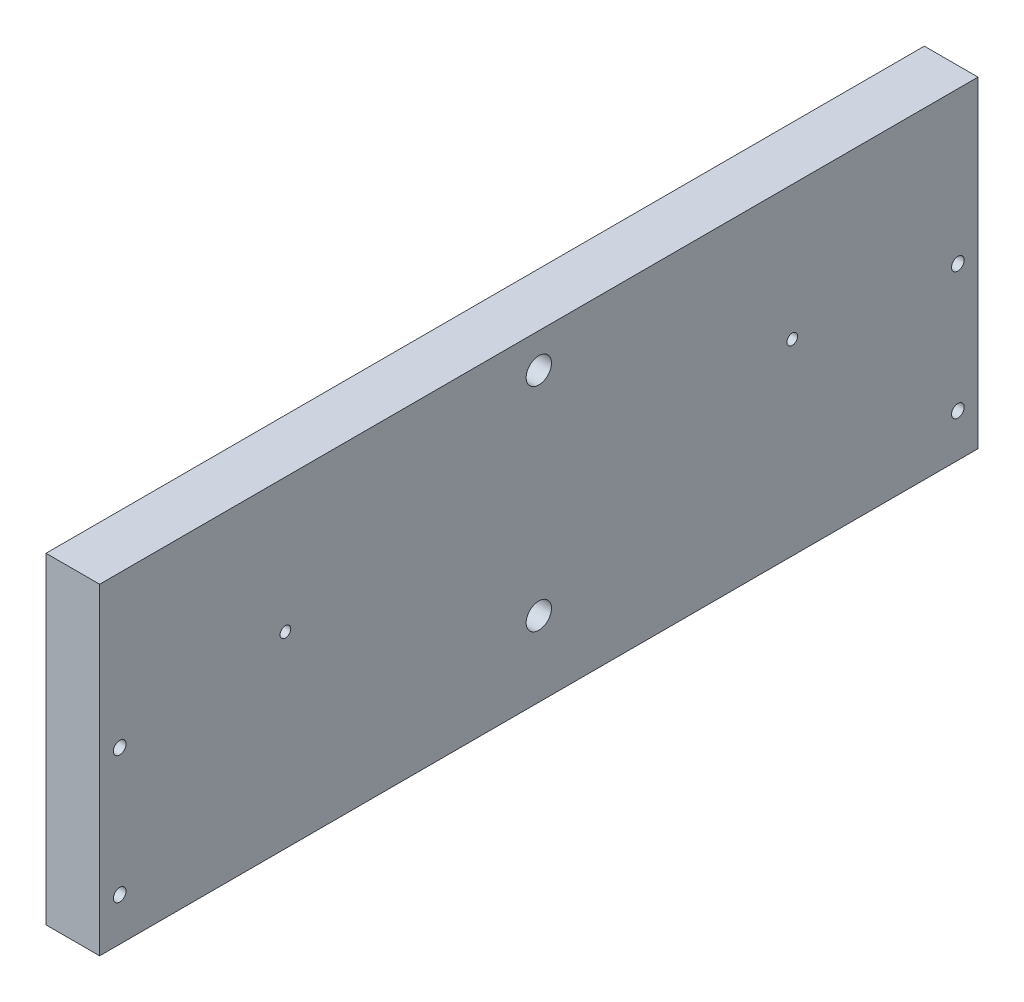
ISO-10303-21;
HEADER;
FILE_DESCRIPTION(('STEP AP214'),'2;1');
FILE_NAME('part.step','',(''),(''),'','','');
FILE_SCHEMA(('AUTOMOTIVE_DESIGN { 1 0 10303 214 1 1 1 1 }'));
ENDSEC;
DATA;
#1=APPLICATION_CONTEXT('core data for automotive mechanical design processes');
#2=APPLICATION_PROTOCOL_DEFINITION('international standard','automotive_design',2000,#1);
#3=PRODUCT_CONTEXT('',#1,'mechanical');
#4=PRODUCT('Part','Part','',(#3));
#5=PRODUCT_RELATED_PRODUCT_CATEGORY('part','',(#4));
#6=PRODUCT_DEFINITION_FORMATION('','',#4);
#7=PRODUCT_DEFINITION_CONTEXT('part definition',#1,'design');
#8=PRODUCT_DEFINITION('design','',#6,#7);
#9=PRODUCT_DEFINITION_SHAPE('','',#8);
#10=(LENGTH_UNIT() NAMED_UNIT(*) SI_UNIT(.MILLI.,.METRE.));
#11=(NAMED_UNIT(*) PLANE_ANGLE_UNIT() SI_UNIT($,.RADIAN.));
#12=(NAMED_UNIT(*) SI_UNIT($,.STERADIAN.) SOLID_ANGLE_UNIT());
#13=UNCERTAINTY_MEASURE_WITH_UNIT(LENGTH_MEASURE(1.E-05),#10,'distance_accuracy_value','');
#14=(GEOMETRIC_REPRESENTATION_CONTEXT(3) GLOBAL_UNCERTAINTY_ASSIGNED_CONTEXT((#13)) GLOBAL_UNIT_ASSIGNED_CONTEXT((#10,
#11,#12)) REPRESENTATION_CONTEXT('',''));
#15=CARTESIAN_POINT('',(0.,0.,0.));
#16=DIRECTION('',(0.,0.,1.));
#17=DIRECTION('',(1.,0.,0.));
#18=AXIS2_PLACEMENT_3D('',#15,#16,#17);
#19=CARTESIAN_POINT('',(12.7,0.,0.));
#20=DIRECTION('',(-1.,0.,0.));
#21=DIRECTION('',(0.,0.,1.));
#22=AXIS2_PLACEMENT_3D('',#19,#20,#21);
#23=PLANE('',#22);
#24=DIRECTION('',(0.,-1.,0.));
#25=VECTOR('',#24,1.);
#26=CARTESIAN_POINT('',(12.7,0.,0.));
#27=LINE('',#26,#25);
#28=CARTESIAN_POINT('',(12.7,76.2,0.));
#29=VERTEX_POINT('',#28);
#30=CARTESIAN_POINT('',(12.7,0.,0.));
#31=VERTEX_POINT('',#30);
#32=EDGE_CURVE('E85',#29,#31,#27,.T.);
#33=ORIENTED_EDGE('',*,*,#32,.T.);
#34=DIRECTION('',(0.,0.,-1.));
#35=VECTOR('',#34,1.);
#36=CARTESIAN_POINT('',(12.7,0.,0.));
#37=LINE('',#36,#35);
#38=CARTESIAN_POINT('',(12.7,0.,-207.9625));
#39=VERTEX_POINT('',#38);
#40=EDGE_CURVE('E80',#31,#39,#37,.T.);
#41=ORIENTED_EDGE('',*,*,#40,.T.);
#42=DIRECTION('',(0.,1.,0.));
#43=VECTOR('',#42,1.);
#44=CARTESIAN_POINT('',(12.7,0.,-207.9625));
#45=LINE('',#44,#43);
#46=CARTESIAN_POINT('',(12.7,76.2,-207.9625));
#47=VERTEX_POINT('',#46);
#48=EDGE_CURVE('E83',#39,#47,#45,.T.);
#49=ORIENTED_EDGE('',*,*,#48,.T.);
#50=DIRECTION('',(0.,0.,1.));
#51=VECTOR('',#50,1.);
#52=CARTESIAN_POINT('',(12.7,76.2,0.));
#53=LINE('',#52,#51);
#54=EDGE_CURVE('E50',#47,#29,#53,.T.);
#55=ORIENTED_EDGE('',*,*,#54,.T.);
#56=EDGE_LOOP('',(#33,#41,#49,#55));
#57=FACE_BOUND('',#56,.T.);
#58=CARTESIAN_POINT('',(12.7,68.072,-103.98125));
#59=DIRECTION('',(1.,0.,0.));
#60=DIRECTION('',(0.,0.,-1.));
#61=AXIS2_PLACEMENT_3D('',#58,#59,#60);
#62=CIRCLE('',#61,3.00000000000001);
#63=CARTESIAN_POINT('',(12.7,68.072,-106.98125));
#64=VERTEX_POINT('',#63);
#65=EDGE_CURVE('E100',#64,#64,#62,.T.);
#66=ORIENTED_EDGE('',*,*,#65,.F.);
#67=EDGE_LOOP('',(#66));
#68=FACE_BOUND('',#67,.T.);
#69=CARTESIAN_POINT('',(12.7,17.78,-103.98125));
#70=DIRECTION('',(1.,0.,0.));
#71=DIRECTION('',(0.,0.,-1.));
#72=AXIS2_PLACEMENT_3D('',#69,#70,#71);
#73=CIRCLE('',#72,3.00000000000001);
#74=CARTESIAN_POINT('',(12.7,17.78,-106.98125));
#75=VERTEX_POINT('',#74);
#76=EDGE_CURVE('E115',#75,#75,#73,.T.);
#77=ORIENTED_EDGE('',*,*,#76,.F.);
#78=EDGE_LOOP('',(#77));
#79=FACE_BOUND('',#78,.T.);
#80=CARTESIAN_POINT('',(12.7,44.45,-43.981250056));
#81=DIRECTION('',(1.,0.,0.));
#82=DIRECTION('',(0.,0.,-1.));
#83=AXIS2_PLACEMENT_3D('',#80,#81,#82);
#84=CIRCLE('',#83,1.26999999999999);
#85=CARTESIAN_POINT('',(12.7,44.45,-45.251250056));
#86=VERTEX_POINT('',#85);
#87=EDGE_CURVE('E121',#86,#86,#84,.T.);
#88=ORIENTED_EDGE('',*,*,#87,.F.);
#89=EDGE_LOOP('',(#88));
#90=FACE_BOUND('',#89,.T.);
#91=CARTESIAN_POINT('',(12.7,44.45,-163.981249944));
#92=DIRECTION('',(1.,0.,0.));
#93=DIRECTION('',(0.,0.,-1.));
#94=AXIS2_PLACEMENT_3D('',#91,#92,#93);
#95=CIRCLE('',#94,1.27000000000003);
#96=CARTESIAN_POINT('',(12.7,44.45,-165.251249944));
#97=VERTEX_POINT('',#96);
#98=EDGE_CURVE('E127',#97,#97,#95,.T.);
#99=ORIENTED_EDGE('',*,*,#98,.F.);
#100=EDGE_LOOP('',(#99));
#101=FACE_BOUND('',#100,.T.);
#102=CARTESIAN_POINT('',(12.7,40.3225,-4.7625));
#103=DIRECTION('',(1.,0.,0.));
#104=DIRECTION('',(0.,0.,-1.));
#105=AXIS2_PLACEMENT_3D('',#102,#103,#104);
#106=CIRCLE('',#105,1.5);
#107=CARTESIAN_POINT('',(12.7,40.3225,-6.2625));
#108=VERTEX_POINT('',#107);
#109=EDGE_CURVE('E133',#108,#108,#106,.T.);
#110=ORIENTED_EDGE('',*,*,#109,.F.);
#111=EDGE_LOOP('',(#110));
#112=FACE_BOUND('',#111,.T.);
#113=CARTESIAN_POINT('',(12.7,10.16,-4.7625));
#114=DIRECTION('',(1.,0.,0.));
#115=DIRECTION('',(0.,0.,-1.));
#116=AXIS2_PLACEMENT_3D('',#113,#114,#115);
#117=CIRCLE('',#116,1.5);
#118=CARTESIAN_POINT('',(12.7,10.16,-6.2625));
#119=VERTEX_POINT('',#118);
#120=EDGE_CURVE('E139',#119,#119,#117,.T.);
#121=ORIENTED_EDGE('',*,*,#120,.F.);
#122=EDGE_LOOP('',(#121));
#123=FACE_BOUND('',#122,.T.);
#124=CARTESIAN_POINT('',(12.7,40.3225,-203.2));
#125=DIRECTION('',(1.,0.,0.));
#126=DIRECTION('',(0.,0.,-1.));
#127=AXIS2_PLACEMENT_3D('',#124,#125,#126);
#128=CIRCLE('',#127,1.5);
#129=CARTESIAN_POINT('',(12.7,40.3225,-204.7));
#130=VERTEX_POINT('',#129);
#131=EDGE_CURVE('E145',#130,#130,#128,.T.);
#132=ORIENTED_EDGE('',*,*,#131,.F.);
#133=EDGE_LOOP('',(#132));
#134=FACE_BOUND('',#133,.T.);
#135=CARTESIAN_POINT('',(12.7,10.16,-203.2));
#136=DIRECTION('',(1.,0.,0.));
#137=DIRECTION('',(0.,0.,-1.));
#138=AXIS2_PLACEMENT_3D('',#135,#136,#137);
#139=CIRCLE('',#138,1.5);
#140=CARTESIAN_POINT('',(12.7,10.16,-204.7));
#141=VERTEX_POINT('',#140);
#142=EDGE_CURVE('E151',#141,#141,#139,.T.);
#143=ORIENTED_EDGE('',*,*,#142,.F.);
#144=EDGE_LOOP('',(#143));
#145=FACE_BOUND('',#144,.T.);
#146=ADVANCED_FACE('F33',(#57,#68,#79,#90,#101,#112,#123,#134,#145),#23,.F.);
#147=CARTESIAN_POINT('',(0.,0.,0.));
#148=DIRECTION('',(-1.,0.,0.));
#149=DIRECTION('',(0.,0.,1.));
#150=AXIS2_PLACEMENT_3D('',#147,#148,#149);
#151=PLANE('',#150);
#152=CARTESIAN_POINT('',(0.,40.3225,-203.2));
#153=DIRECTION('',(1.,0.,0.));
#154=DIRECTION('',(0.,0.,-1.));
#155=AXIS2_PLACEMENT_3D('',#152,#153,#154);
#156=CIRCLE('',#155,1.5);
#157=CARTESIAN_POINT('',(0.,40.3225,-204.7));
#158=VERTEX_POINT('',#157);
#159=EDGE_CURVE('E148',#158,#158,#156,.T.);
#160=ORIENTED_EDGE('',*,*,#159,.T.);
#161=EDGE_LOOP('',(#160));
#162=FACE_BOUND('',#161,.T.);
#163=CARTESIAN_POINT('',(0.,40.3225,-4.7625));
#164=DIRECTION('',(1.,0.,0.));
#165=DIRECTION('',(0.,0.,-1.));
#166=AXIS2_PLACEMENT_3D('',#163,#164,#165);
#167=CIRCLE('',#166,1.5);
#168=CARTESIAN_POINT('',(0.,40.3225,-6.2625));
#169=VERTEX_POINT('',#168);
#170=EDGE_CURVE('E136',#169,#169,#167,.T.);
#171=ORIENTED_EDGE('',*,*,#170,.T.);
#172=EDGE_LOOP('',(#171));
#173=FACE_BOUND('',#172,.T.);
#174=CARTESIAN_POINT('',(0.,44.45,-43.981250056));
#175=DIRECTION('',(1.,0.,0.));
#176=DIRECTION('',(0.,0.,-1.));
#177=AXIS2_PLACEMENT_3D('',#174,#175,#176);
#178=CIRCLE('',#177,1.26999999999999);
#179=CARTESIAN_POINT('',(0.,44.45,-45.251250056));
#180=VERTEX_POINT('',#179);
#181=EDGE_CURVE('E124',#180,#180,#178,.T.);
#182=ORIENTED_EDGE('',*,*,#181,.T.);
#183=EDGE_LOOP('',(#182));
#184=FACE_BOUND('',#183,.T.);
#185=CARTESIAN_POINT('',(0.,68.072,-103.98125));
#186=DIRECTION('',(1.,0.,0.));
#187=DIRECTION('',(0.,0.,-1.));
#188=AXIS2_PLACEMENT_3D('',#185,#186,#187);
#189=CIRCLE('',#188,3.00000000000001);
#190=CARTESIAN_POINT('',(0.,68.072,-106.98125));
#191=VERTEX_POINT('',#190);
#192=EDGE_CURVE('E112',#191,#191,#189,.T.);
#193=ORIENTED_EDGE('',*,*,#192,.T.);
#194=EDGE_LOOP('',(#193));
#195=FACE_BOUND('',#194,.T.);
#196=DIRECTION('',(0.,-1.,0.));
#197=VECTOR('',#196,1.);
#198=CARTESIAN_POINT('',(0.,0.,0.));
#199=LINE('',#198,#197);
#200=CARTESIAN_POINT('',(0.,76.2,0.));
#201=VERTEX_POINT('',#200);
#202=CARTESIAN_POINT('',(0.,0.,0.));
#203=VERTEX_POINT('',#202);
#204=EDGE_CURVE('E97',#201,#203,#199,.T.);
#205=ORIENTED_EDGE('',*,*,#204,.F.);
#206=DIRECTION('',(0.,0.,1.));
#207=VECTOR('',#206,1.);
#208=CARTESIAN_POINT('',(0.,76.2,0.));
#209=LINE('',#208,#207);
#210=CARTESIAN_POINT('',(0.,76.2,-207.9625));
#211=VERTEX_POINT('',#210);
#212=EDGE_CURVE('E73',#211,#201,#209,.T.);
#213=ORIENTED_EDGE('',*,*,#212,.F.);
#214=DIRECTION('',(0.,1.,0.));
#215=VECTOR('',#214,1.);
#216=CARTESIAN_POINT('',(0.,0.,-207.9625));
#217=LINE('',#216,#215);
#218=CARTESIAN_POINT('',(0.,0.,-207.9625));
#219=VERTEX_POINT('',#218);
#220=EDGE_CURVE('E67',#219,#211,#217,.T.);
#221=ORIENTED_EDGE('',*,*,#220,.F.);
#222=DIRECTION('',(0.,0.,-1.));
#223=VECTOR('',#222,1.);
#224=CARTESIAN_POINT('',(0.,0.,0.));
#225=LINE('',#224,#223);
#226=EDGE_CURVE('E89',#203,#219,#225,.T.);
#227=ORIENTED_EDGE('',*,*,#226,.F.);
#228=EDGE_LOOP('',(#205,#213,#221,#227));
#229=FACE_BOUND('',#228,.T.);
#230=CARTESIAN_POINT('',(0.,17.78,-103.98125));
#231=DIRECTION('',(1.,0.,0.));
#232=DIRECTION('',(0.,0.,-1.));
#233=AXIS2_PLACEMENT_3D('',#230,#231,#232);
#234=CIRCLE('',#233,3.00000000000001);
#235=CARTESIAN_POINT('',(0.,17.78,-106.98125));
#236=VERTEX_POINT('',#235);
#237=EDGE_CURVE('E118',#236,#236,#234,.T.);
#238=ORIENTED_EDGE('',*,*,#237,.T.);
#239=EDGE_LOOP('',(#238));
#240=FACE_BOUND('',#239,.T.);
#241=CARTESIAN_POINT('',(0.,44.45,-163.981249944));
#242=DIRECTION('',(1.,0.,0.));
#243=DIRECTION('',(0.,0.,-1.));
#244=AXIS2_PLACEMENT_3D('',#241,#242,#243);
#245=CIRCLE('',#244,1.27000000000003);
#246=CARTESIAN_POINT('',(0.,44.45,-165.251249944));
#247=VERTEX_POINT('',#246);
#248=EDGE_CURVE('E130',#247,#247,#245,.T.);
#249=ORIENTED_EDGE('',*,*,#248,.T.);
#250=EDGE_LOOP('',(#249));
#251=FACE_BOUND('',#250,.T.);
#252=CARTESIAN_POINT('',(0.,10.16,-4.7625));
#253=DIRECTION('',(1.,0.,0.));
#254=DIRECTION('',(0.,0.,-1.));
#255=AXIS2_PLACEMENT_3D('',#252,#253,#254);
#256=CIRCLE('',#255,1.5);
#257=CARTESIAN_POINT('',(0.,10.16,-6.2625));
#258=VERTEX_POINT('',#257);
#259=EDGE_CURVE('E142',#258,#258,#256,.T.);
#260=ORIENTED_EDGE('',*,*,#259,.T.);
#261=EDGE_LOOP('',(#260));
#262=FACE_BOUND('',#261,.T.);
#263=CARTESIAN_POINT('',(0.,10.16,-203.2));
#264=DIRECTION('',(1.,0.,0.));
#265=DIRECTION('',(0.,0.,-1.));
#266=AXIS2_PLACEMENT_3D('',#263,#264,#265);
#267=CIRCLE('',#266,1.5);
#268=CARTESIAN_POINT('',(0.,10.16,-204.7));
#269=VERTEX_POINT('',#268);
#270=EDGE_CURVE('E154',#269,#269,#267,.T.);
#271=ORIENTED_EDGE('',*,*,#270,.T.);
#272=EDGE_LOOP('',(#271));
#273=FACE_BOUND('',#272,.T.);
#274=ADVANCED_FACE('F108',(#162,#173,#184,#195,#229,#240,#251,#262,#273),#151,.T.);
#275=CARTESIAN_POINT('',(12.7,0.,0.));
#276=DIRECTION('',(0.,0.,-1.));
#277=DIRECTION('',(-1.,0.,0.));
#278=AXIS2_PLACEMENT_3D('',#275,#276,#277);
#279=PLANE('',#278);
#280=ORIENTED_EDGE('',*,*,#204,.T.);
#281=DIRECTION('',(-1.,0.,0.));
#282=VECTOR('',#281,1.);
#283=CARTESIAN_POINT('',(12.7,0.,0.));
#284=LINE('',#283,#282);
#285=EDGE_CURVE('E11',#31,#203,#284,.T.);
#286=ORIENTED_EDGE('',*,*,#285,.F.);
#287=ORIENTED_EDGE('',*,*,#32,.F.);
#288=DIRECTION('',(-1.,0.,0.));
#289=VECTOR('',#288,1.);
#290=CARTESIAN_POINT('',(12.7,76.2,0.));
#291=LINE('',#290,#289);
#292=EDGE_CURVE('E93',#29,#201,#291,.T.);
#293=ORIENTED_EDGE('',*,*,#292,.T.);
#294=EDGE_LOOP('',(#280,#286,#287,#293));
#295=FACE_BOUND('',#294,.T.);
#296=ADVANCED_FACE('F35',(#295),#279,.F.);
#297=CARTESIAN_POINT('',(12.7,0.,0.));
#298=DIRECTION('',(0.,1.,0.));
#299=DIRECTION('',(0.,0.,1.));
#300=AXIS2_PLACEMENT_3D('',#297,#298,#299);
#301=PLANE('',#300);
#302=ORIENTED_EDGE('',*,*,#226,.T.);
#303=DIRECTION('',(-1.,0.,0.));
#304=VECTOR('',#303,1.);
#305=CARTESIAN_POINT('',(12.7,0.,-207.9625));
#306=LINE('',#305,#304);
#307=EDGE_CURVE('E42',#39,#219,#306,.T.);
#308=ORIENTED_EDGE('',*,*,#307,.F.);
#309=ORIENTED_EDGE('',*,*,#40,.F.);
#310=ORIENTED_EDGE('',*,*,#285,.T.);
#311=EDGE_LOOP('',(#302,#308,#309,#310));
#312=FACE_BOUND('',#311,.T.);
#313=ADVANCED_FACE('F88',(#312),#301,.F.);
#314=CARTESIAN_POINT('',(12.7,0.,-207.9625));
#315=DIRECTION('',(0.,0.,1.));
#316=DIRECTION('',(1.,0.,0.));
#317=AXIS2_PLACEMENT_3D('',#314,#315,#316);
#318=PLANE('',#317);
#319=ORIENTED_EDGE('',*,*,#220,.T.);
#320=DIRECTION('',(-1.,0.,0.));
#321=VECTOR('',#320,1.);
#322=CARTESIAN_POINT('',(12.7,76.2,-207.9625));
#323=LINE('',#322,#321);
#324=EDGE_CURVE('E90',#47,#211,#323,.T.);
#325=ORIENTED_EDGE('',*,*,#324,.F.);
#326=ORIENTED_EDGE('',*,*,#48,.F.);
#327=ORIENTED_EDGE('',*,*,#307,.T.);
#328=EDGE_LOOP('',(#319,#325,#326,#327));
#329=FACE_BOUND('',#328,.T.);
#330=ADVANCED_FACE('F91',(#329),#318,.F.);
#331=CARTESIAN_POINT('',(12.7,76.2,0.));
#332=DIRECTION('',(0.,-1.,0.));
#333=DIRECTION('',(0.,0.,-1.));
#334=AXIS2_PLACEMENT_3D('',#331,#332,#333);
#335=PLANE('',#334);
#336=ORIENTED_EDGE('',*,*,#212,.T.);
#337=ORIENTED_EDGE('',*,*,#292,.F.);
#338=ORIENTED_EDGE('',*,*,#54,.F.);
#339=ORIENTED_EDGE('',*,*,#324,.T.);
#340=EDGE_LOOP('',(#336,#337,#338,#339));
#341=FACE_BOUND('',#340,.T.);
#342=ADVANCED_FACE('F105',(#341),#335,.F.);
#343=CARTESIAN_POINT('',(12.7,68.072,-103.98125));
#344=DIRECTION('',(-1.,0.,0.));
#345=DIRECTION('',(0.,0.,1.));
#346=AXIS2_PLACEMENT_3D('',#343,#344,#345);
#347=CYLINDRICAL_SURFACE('',#346,3.00000000000001);
#348=ORIENTED_EDGE('',*,*,#65,.T.);
#349=EDGE_LOOP('',(#348));
#350=FACE_BOUND('',#349,.T.);
#351=ORIENTED_EDGE('',*,*,#192,.F.);
#352=EDGE_LOOP('',(#351));
#353=FACE_BOUND('',#352,.T.);
#354=ADVANCED_FACE('F171',(#350,#353),#347,.F.);
#355=CARTESIAN_POINT('',(12.7,17.78,-103.98125));
#356=DIRECTION('',(-1.,0.,0.));
#357=DIRECTION('',(0.,0.,1.));
#358=AXIS2_PLACEMENT_3D('',#355,#356,#357);
#359=CYLINDRICAL_SURFACE('',#358,3.00000000000001);
#360=ORIENTED_EDGE('',*,*,#76,.T.);
#361=EDGE_LOOP('',(#360));
#362=FACE_BOUND('',#361,.T.);
#363=ORIENTED_EDGE('',*,*,#237,.F.);
#364=EDGE_LOOP('',(#363));
#365=FACE_BOUND('',#364,.T.);
#366=ADVANCED_FACE('F217',(#362,#365),#359,.F.);
#367=CARTESIAN_POINT('',(12.7,44.45,-43.981250056));
#368=DIRECTION('',(-1.,0.,0.));
#369=DIRECTION('',(0.,0.,1.));
#370=AXIS2_PLACEMENT_3D('',#367,#368,#369);
#371=CYLINDRICAL_SURFACE('',#370,1.26999999999999);
#372=ORIENTED_EDGE('',*,*,#87,.T.);
#373=EDGE_LOOP('',(#372));
#374=FACE_BOUND('',#373,.T.);
#375=ORIENTED_EDGE('',*,*,#181,.F.);
#376=EDGE_LOOP('',(#375));
#377=FACE_BOUND('',#376,.T.);
#378=ADVANCED_FACE('F225',(#374,#377),#371,.F.);
#379=CARTESIAN_POINT('',(12.7,44.45,-163.981249944));
#380=DIRECTION('',(-1.,0.,0.));
#381=DIRECTION('',(0.,0.,1.));
#382=AXIS2_PLACEMENT_3D('',#379,#380,#381);
#383=CYLINDRICAL_SURFACE('',#382,1.27000000000003);
#384=ORIENTED_EDGE('',*,*,#98,.T.);
#385=EDGE_LOOP('',(#384));
#386=FACE_BOUND('',#385,.T.);
#387=ORIENTED_EDGE('',*,*,#248,.F.);
#388=EDGE_LOOP('',(#387));
#389=FACE_BOUND('',#388,.T.);
#390=ADVANCED_FACE('F233',(#386,#389),#383,.F.);
#391=CARTESIAN_POINT('',(12.7,40.3225,-4.7625));
#392=DIRECTION('',(-1.,0.,0.));
#393=DIRECTION('',(0.,0.,1.));
#394=AXIS2_PLACEMENT_3D('',#391,#392,#393);
#395=CYLINDRICAL_SURFACE('',#394,1.5);
#396=ORIENTED_EDGE('',*,*,#109,.T.);
#397=EDGE_LOOP('',(#396));
#398=FACE_BOUND('',#397,.T.);
#399=ORIENTED_EDGE('',*,*,#170,.F.);
#400=EDGE_LOOP('',(#399));
#401=FACE_BOUND('',#400,.T.);
#402=ADVANCED_FACE('F242',(#398,#401),#395,.F.);
#403=CARTESIAN_POINT('',(12.7,10.16,-4.7625));
#404=DIRECTION('',(-1.,0.,0.));
#405=DIRECTION('',(0.,0.,1.));
#406=AXIS2_PLACEMENT_3D('',#403,#404,#405);
#407=CYLINDRICAL_SURFACE('',#406,1.5);
#408=ORIENTED_EDGE('',*,*,#120,.T.);
#409=EDGE_LOOP('',(#408));
#410=FACE_BOUND('',#409,.T.);
#411=ORIENTED_EDGE('',*,*,#259,.F.);
#412=EDGE_LOOP('',(#411));
#413=FACE_BOUND('',#412,.T.);
#414=ADVANCED_FACE('F251',(#410,#413),#407,.F.);
#415=CARTESIAN_POINT('',(12.7,40.3225,-203.2));
#416=DIRECTION('',(-1.,0.,0.));
#417=DIRECTION('',(0.,0.,1.));
#418=AXIS2_PLACEMENT_3D('',#415,#416,#417);
#419=CYLINDRICAL_SURFACE('',#418,1.5);
#420=ORIENTED_EDGE('',*,*,#131,.T.);
#421=EDGE_LOOP('',(#420));
#422=FACE_BOUND('',#421,.T.);
#423=ORIENTED_EDGE('',*,*,#159,.F.);
#424=EDGE_LOOP('',(#423));
#425=FACE_BOUND('',#424,.T.);
#426=ADVANCED_FACE('F260',(#422,#425),#419,.F.);
#427=CARTESIAN_POINT('',(12.7,10.16,-203.2));
#428=DIRECTION('',(-1.,0.,0.));
#429=DIRECTION('',(0.,0.,1.));
#430=AXIS2_PLACEMENT_3D('',#427,#428,#429);
#431=CYLINDRICAL_SURFACE('',#430,1.5);
#432=ORIENTED_EDGE('',*,*,#142,.T.);
#433=EDGE_LOOP('',(#432));
#434=FACE_BOUND('',#433,.T.);
#435=ORIENTED_EDGE('',*,*,#270,.F.);
#436=EDGE_LOOP('',(#435));
#437=FACE_BOUND('',#436,.T.);
#438=ADVANCED_FACE('F160',(#434,#437),#431,.F.);
#439=CLOSED_SHELL('',(#146,#274,#296,#313,#330,#342,#354,#366,#378,#390,#402,#414,#426,#438));
#440=MANIFOLD_SOLID_BREP('B2',#439);
#441=ADVANCED_BREP_SHAPE_REPRESENTATION('',(#18,#440),#14);
#442=SHAPE_DEFINITION_REPRESENTATION(#9,#441);
ENDSEC;
END-ISO-10303-21;
